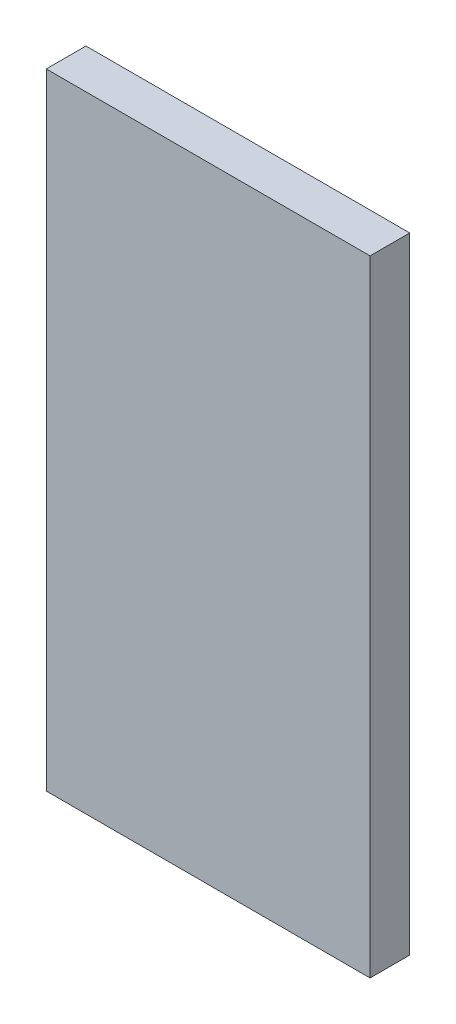
ISO-10303-21;
HEADER;
FILE_DESCRIPTION(('STEP AP214'),'2;1');
FILE_NAME('part.step','',(''),(''),'','','');
FILE_SCHEMA(('AUTOMOTIVE_DESIGN { 1 0 10303 214 1 1 1 1 }'));
ENDSEC;
DATA;
#1=APPLICATION_CONTEXT('core data for automotive mechanical design processes');
#2=APPLICATION_PROTOCOL_DEFINITION('international standard','automotive_design',2000,#1);
#3=PRODUCT_CONTEXT('',#1,'mechanical');
#4=PRODUCT('Part','Part','',(#3));
#5=PRODUCT_RELATED_PRODUCT_CATEGORY('part','',(#4));
#6=PRODUCT_DEFINITION_FORMATION('','',#4);
#7=PRODUCT_DEFINITION_CONTEXT('part definition',#1,'design');
#8=PRODUCT_DEFINITION('design','',#6,#7);
#9=PRODUCT_DEFINITION_SHAPE('','',#8);
#10=(LENGTH_UNIT() NAMED_UNIT(*) SI_UNIT(.MILLI.,.METRE.));
#11=(NAMED_UNIT(*) PLANE_ANGLE_UNIT() SI_UNIT($,.RADIAN.));
#12=(NAMED_UNIT(*) SI_UNIT($,.STERADIAN.) SOLID_ANGLE_UNIT());
#13=UNCERTAINTY_MEASURE_WITH_UNIT(LENGTH_MEASURE(1.E-05),#10,'distance_accuracy_value','');
#14=(GEOMETRIC_REPRESENTATION_CONTEXT(3) GLOBAL_UNCERTAINTY_ASSIGNED_CONTEXT((#13)) GLOBAL_UNIT_ASSIGNED_CONTEXT((#10,
#11,#12)) REPRESENTATION_CONTEXT('',''));
#15=CARTESIAN_POINT('',(0.,0.,0.));
#16=DIRECTION('',(0.,0.,1.));
#17=DIRECTION('',(1.,0.,0.));
#18=AXIS2_PLACEMENT_3D('',#15,#16,#17);
#19=CARTESIAN_POINT('',(9.752,2.122,0.1));
#20=DIRECTION('',(0.,0.,1.));
#21=DIRECTION('',(1.,0.,0.));
#22=AXIS2_PLACEMENT_3D('',#19,#20,#21);
#23=PLANE('',#22);
#24=DIRECTION('',(0.,1.,0.));
#25=VECTOR('',#24,1.);
#26=CARTESIAN_POINT('',(10.568,2.122,0.1));
#27=LINE('',#26,#25);
#28=CARTESIAN_POINT('',(10.568,3.698,0.1));
#29=VERTEX_POINT('',#28);
#30=CARTESIAN_POINT('',(10.568,2.122,0.1));
#31=VERTEX_POINT('',#30);
#32=EDGE_CURVE('E75',#29,#31,#27,.F.);
#33=ORIENTED_EDGE('',*,*,#32,.F.);
#34=DIRECTION('',(1.,0.,0.));
#35=VECTOR('',#34,1.);
#36=CARTESIAN_POINT('',(9.752,3.698,0.1));
#37=LINE('',#36,#35);
#38=CARTESIAN_POINT('',(9.752,3.698,0.1));
#39=VERTEX_POINT('',#38);
#40=EDGE_CURVE('E57',#39,#29,#37,.T.);
#41=ORIENTED_EDGE('',*,*,#40,.F.);
#42=DIRECTION('',(0.,1.,0.));
#43=VECTOR('',#42,1.);
#44=CARTESIAN_POINT('',(9.752,2.122,0.1));
#45=LINE('',#44,#43);
#46=CARTESIAN_POINT('',(9.752,2.122,0.1));
#47=VERTEX_POINT('',#46);
#48=EDGE_CURVE('E19',#39,#47,#45,.F.);
#49=ORIENTED_EDGE('',*,*,#48,.T.);
#50=DIRECTION('',(1.,0.,0.));
#51=VECTOR('',#50,1.);
#52=CARTESIAN_POINT('',(9.752,2.122,0.1));
#53=LINE('',#52,#51);
#54=EDGE_CURVE('E54',#47,#31,#53,.T.);
#55=ORIENTED_EDGE('',*,*,#54,.T.);
#56=EDGE_LOOP('',(#33,#41,#49,#55));
#57=FACE_BOUND('',#56,.T.);
#58=ADVANCED_FACE('F16',(#57),#23,.T.);
#59=CARTESIAN_POINT('',(9.752,2.122,0.));
#60=DIRECTION('',(1.,0.,0.));
#61=DIRECTION('',(0.,0.,-1.));
#62=AXIS2_PLACEMENT_3D('',#59,#60,#61);
#63=PLANE('',#62);
#64=DIRECTION('',(0.,0.,1.));
#65=VECTOR('',#64,1.);
#66=CARTESIAN_POINT('',(9.752,3.698,0.));
#67=LINE('',#66,#65);
#68=CARTESIAN_POINT('',(9.752,3.698,0.));
#69=VERTEX_POINT('',#68);
#70=EDGE_CURVE('E77',#69,#39,#67,.T.);
#71=ORIENTED_EDGE('',*,*,#70,.F.);
#72=DIRECTION('',(0.,1.,0.));
#73=VECTOR('',#72,1.);
#74=CARTESIAN_POINT('',(9.752,2.122,0.));
#75=LINE('',#74,#73);
#76=CARTESIAN_POINT('',(9.752,2.122,0.));
#77=VERTEX_POINT('',#76);
#78=EDGE_CURVE('E72',#69,#77,#75,.F.);
#79=ORIENTED_EDGE('',*,*,#78,.T.);
#80=DIRECTION('',(0.,0.,1.));
#81=VECTOR('',#80,1.);
#82=CARTESIAN_POINT('',(9.752,2.122,0.));
#83=LINE('',#82,#81);
#84=EDGE_CURVE('E62',#77,#47,#83,.T.);
#85=ORIENTED_EDGE('',*,*,#84,.T.);
#86=ORIENTED_EDGE('',*,*,#48,.F.);
#87=EDGE_LOOP('',(#71,#79,#85,#86));
#88=FACE_BOUND('',#87,.T.);
#89=ADVANCED_FACE('F71',(#88),#63,.F.);
#90=CARTESIAN_POINT('',(9.752,2.122,0.));
#91=DIRECTION('',(0.,1.,0.));
#92=DIRECTION('',(0.,0.,1.));
#93=AXIS2_PLACEMENT_3D('',#90,#91,#92);
#94=PLANE('',#93);
#95=ORIENTED_EDGE('',*,*,#54,.F.);
#96=ORIENTED_EDGE('',*,*,#84,.F.);
#97=DIRECTION('',(1.,0.,0.));
#98=VECTOR('',#97,1.);
#99=CARTESIAN_POINT('',(9.752,2.122,0.));
#100=LINE('',#99,#98);
#101=CARTESIAN_POINT('',(10.568,2.122,0.));
#102=VERTEX_POINT('',#101);
#103=EDGE_CURVE('E82',#77,#102,#100,.T.);
#104=ORIENTED_EDGE('',*,*,#103,.T.);
#105=DIRECTION('',(0.,0.,-1.));
#106=VECTOR('',#105,1.);
#107=CARTESIAN_POINT('',(10.568,2.122,0.));
#108=LINE('',#107,#106);
#109=EDGE_CURVE('E68',#31,#102,#108,.T.);
#110=ORIENTED_EDGE('',*,*,#109,.F.);
#111=EDGE_LOOP('',(#95,#96,#104,#110));
#112=FACE_BOUND('',#111,.T.);
#113=ADVANCED_FACE('F65',(#112),#94,.F.);
#114=CARTESIAN_POINT('',(10.568,2.122,0.));
#115=DIRECTION('',(1.,0.,0.));
#116=DIRECTION('',(0.,0.,-1.));
#117=AXIS2_PLACEMENT_3D('',#114,#115,#116);
#118=PLANE('',#117);
#119=DIRECTION('',(0.,0.,1.));
#120=VECTOR('',#119,1.);
#121=CARTESIAN_POINT('',(10.568,3.698,0.));
#122=LINE('',#121,#120);
#123=CARTESIAN_POINT('',(10.568,3.698,0.));
#124=VERTEX_POINT('',#123);
#125=EDGE_CURVE('E33',#29,#124,#122,.F.);
#126=ORIENTED_EDGE('',*,*,#125,.F.);
#127=ORIENTED_EDGE('',*,*,#32,.T.);
#128=ORIENTED_EDGE('',*,*,#109,.T.);
#129=DIRECTION('',(0.,1.,0.));
#130=VECTOR('',#129,1.);
#131=CARTESIAN_POINT('',(10.568,2.122,0.));
#132=LINE('',#131,#130);
#133=EDGE_CURVE('E25',#102,#124,#132,.T.);
#134=ORIENTED_EDGE('',*,*,#133,.T.);
#135=EDGE_LOOP('',(#126,#127,#128,#134));
#136=FACE_BOUND('',#135,.T.);
#137=ADVANCED_FACE('F87',(#136),#118,.T.);
#138=CARTESIAN_POINT('',(9.752,3.698,0.));
#139=DIRECTION('',(0.,1.,0.));
#140=DIRECTION('',(0.,0.,1.));
#141=AXIS2_PLACEMENT_3D('',#138,#139,#140);
#142=PLANE('',#141);
#143=ORIENTED_EDGE('',*,*,#40,.T.);
#144=ORIENTED_EDGE('',*,*,#125,.T.);
#145=DIRECTION('',(1.,0.,0.));
#146=VECTOR('',#145,1.);
#147=CARTESIAN_POINT('',(9.752,3.698,0.));
#148=LINE('',#147,#146);
#149=EDGE_CURVE('E11',#124,#69,#148,.F.);
#150=ORIENTED_EDGE('',*,*,#149,.T.);
#151=ORIENTED_EDGE('',*,*,#70,.T.);
#152=EDGE_LOOP('',(#143,#144,#150,#151));
#153=FACE_BOUND('',#152,.T.);
#154=ADVANCED_FACE('F90',(#153),#142,.T.);
#155=CARTESIAN_POINT('',(9.752,2.122,0.));
#156=DIRECTION('',(0.,0.,1.));
#157=DIRECTION('',(1.,0.,0.));
#158=AXIS2_PLACEMENT_3D('',#155,#156,#157);
#159=PLANE('',#158);
#160=ORIENTED_EDGE('',*,*,#133,.F.);
#161=ORIENTED_EDGE('',*,*,#103,.F.);
#162=ORIENTED_EDGE('',*,*,#78,.F.);
#163=ORIENTED_EDGE('',*,*,#149,.F.);
#164=EDGE_LOOP('',(#160,#161,#162,#163));
#165=FACE_BOUND('',#164,.T.);
#166=ADVANCED_FACE('F89',(#165),#159,.F.);
#167=CLOSED_SHELL('',(#58,#89,#113,#137,#154,#166));
#168=MANIFOLD_SOLID_BREP('B1',#167);
#169=ADVANCED_BREP_SHAPE_REPRESENTATION('',(#18,#168),#14);
#170=SHAPE_DEFINITION_REPRESENTATION(#9,#169);
ENDSEC;
END-ISO-10303-21;
